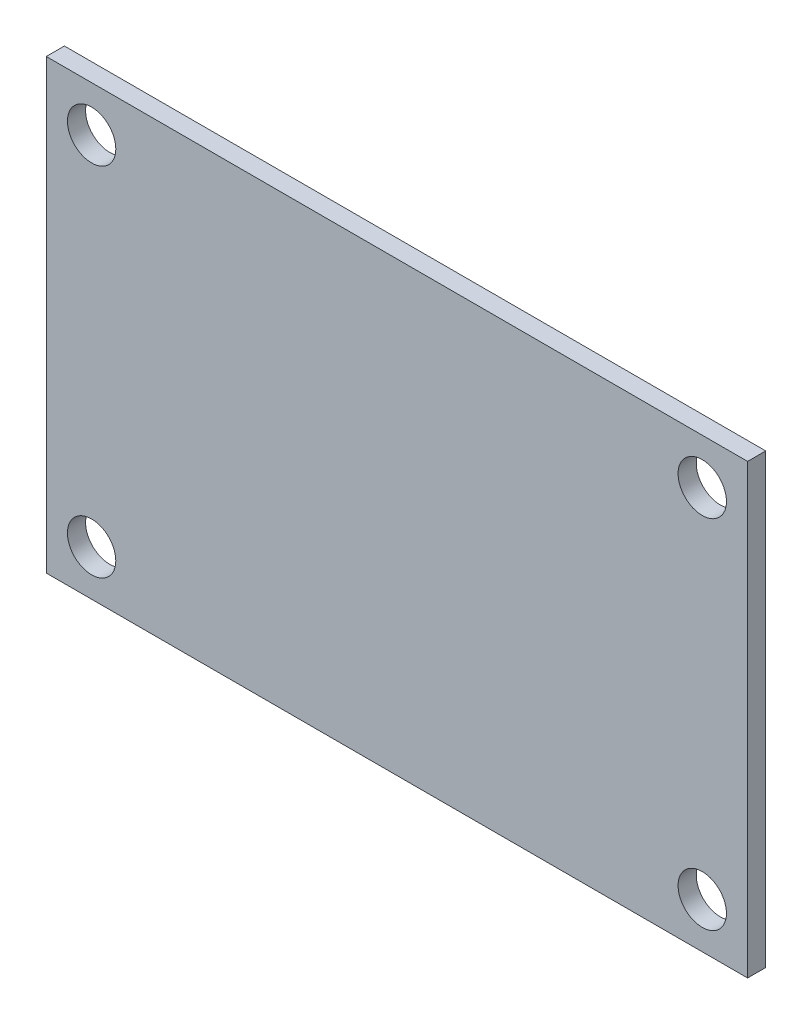
ISO-10303-21;
HEADER;
FILE_DESCRIPTION(('STEP AP214'),'2;1');
FILE_NAME('part.step','',(''),(''),'','','');
FILE_SCHEMA(('AUTOMOTIVE_DESIGN { 1 0 10303 214 1 1 1 1 }'));
ENDSEC;
DATA;
#1=APPLICATION_CONTEXT('core data for automotive mechanical design processes');
#2=APPLICATION_PROTOCOL_DEFINITION('international standard','automotive_design',2000,#1);
#3=PRODUCT_CONTEXT('',#1,'mechanical');
#4=PRODUCT('Part','Part','',(#3));
#5=PRODUCT_RELATED_PRODUCT_CATEGORY('part','',(#4));
#6=PRODUCT_DEFINITION_FORMATION('','',#4);
#7=PRODUCT_DEFINITION_CONTEXT('part definition',#1,'design');
#8=PRODUCT_DEFINITION('design','',#6,#7);
#9=PRODUCT_DEFINITION_SHAPE('','',#8);
#10=(LENGTH_UNIT() NAMED_UNIT(*) SI_UNIT(.MILLI.,.METRE.));
#11=(NAMED_UNIT(*) PLANE_ANGLE_UNIT() SI_UNIT($,.RADIAN.));
#12=(NAMED_UNIT(*) SI_UNIT($,.STERADIAN.) SOLID_ANGLE_UNIT());
#13=UNCERTAINTY_MEASURE_WITH_UNIT(LENGTH_MEASURE(1.E-05),#10,'distance_accuracy_value','');
#14=(GEOMETRIC_REPRESENTATION_CONTEXT(3) GLOBAL_UNCERTAINTY_ASSIGNED_CONTEXT((#13)) GLOBAL_UNIT_ASSIGNED_CONTEXT((#10,
#11,#12)) REPRESENTATION_CONTEXT('',''));
#15=CARTESIAN_POINT('',(0.,0.,0.));
#16=DIRECTION('',(0.,0.,1.));
#17=DIRECTION('',(1.,0.,0.));
#18=AXIS2_PLACEMENT_3D('',#15,#16,#17);
#19=CARTESIAN_POINT('',(0.,0.,1.5));
#20=DIRECTION('',(0.,0.,-1.));
#21=DIRECTION('',(-1.,0.,0.));
#22=AXIS2_PLACEMENT_3D('',#19,#20,#21);
#23=PLANE('',#22);
#24=DIRECTION('',(0.,-1.,0.));
#25=VECTOR('',#24,1.);
#26=CARTESIAN_POINT('',(0.,0.,1.5));
#27=LINE('',#26,#25);
#28=CARTESIAN_POINT('',(0.,37.,1.5));
#29=VERTEX_POINT('',#28);
#30=CARTESIAN_POINT('',(0.,0.,1.5));
#31=VERTEX_POINT('',#30);
#32=EDGE_CURVE('E85',#29,#31,#27,.T.);
#33=ORIENTED_EDGE('',*,*,#32,.T.);
#34=DIRECTION('',(1.,0.,0.));
#35=VECTOR('',#34,1.);
#36=CARTESIAN_POINT('',(0.,0.,1.5));
#37=LINE('',#36,#35);
#38=CARTESIAN_POINT('',(58.,0.,1.5));
#39=VERTEX_POINT('',#38);
#40=EDGE_CURVE('E80',#31,#39,#37,.T.);
#41=ORIENTED_EDGE('',*,*,#40,.T.);
#42=DIRECTION('',(0.,1.,0.));
#43=VECTOR('',#42,1.);
#44=CARTESIAN_POINT('',(58.,0.,1.5));
#45=LINE('',#44,#43);
#46=CARTESIAN_POINT('',(58.,37.,1.5));
#47=VERTEX_POINT('',#46);
#48=EDGE_CURVE('E83',#39,#47,#45,.T.);
#49=ORIENTED_EDGE('',*,*,#48,.T.);
#50=DIRECTION('',(-1.,0.,0.));
#51=VECTOR('',#50,1.);
#52=CARTESIAN_POINT('',(0.,37.,1.5));
#53=LINE('',#52,#51);
#54=EDGE_CURVE('E50',#47,#29,#53,.T.);
#55=ORIENTED_EDGE('',*,*,#54,.T.);
#56=EDGE_LOOP('',(#33,#41,#49,#55));
#57=FACE_BOUND('',#56,.T.);
#58=CARTESIAN_POINT('',(3.75,33.25,1.5));
#59=DIRECTION('',(0.,0.,1.));
#60=DIRECTION('',(1.,0.,0.));
#61=AXIS2_PLACEMENT_3D('',#58,#59,#60);
#62=CIRCLE('',#61,2.);
#63=CARTESIAN_POINT('',(5.75,33.25,1.5));
#64=VERTEX_POINT('',#63);
#65=EDGE_CURVE('E100',#64,#64,#62,.T.);
#66=ORIENTED_EDGE('',*,*,#65,.F.);
#67=EDGE_LOOP('',(#66));
#68=FACE_BOUND('',#67,.T.);
#69=CARTESIAN_POINT('',(54.25,33.25,1.5));
#70=DIRECTION('',(0.,0.,1.));
#71=DIRECTION('',(1.,0.,0.));
#72=AXIS2_PLACEMENT_3D('',#69,#70,#71);
#73=CIRCLE('',#72,2.);
#74=CARTESIAN_POINT('',(56.25,33.25,1.5));
#75=VERTEX_POINT('',#74);
#76=EDGE_CURVE('E115',#75,#75,#73,.T.);
#77=ORIENTED_EDGE('',*,*,#76,.F.);
#78=EDGE_LOOP('',(#77));
#79=FACE_BOUND('',#78,.T.);
#80=CARTESIAN_POINT('',(54.25,3.75,1.5));
#81=DIRECTION('',(0.,0.,1.));
#82=DIRECTION('',(1.,0.,0.));
#83=AXIS2_PLACEMENT_3D('',#80,#81,#82);
#84=CIRCLE('',#83,2.);
#85=CARTESIAN_POINT('',(56.25,3.75,1.5));
#86=VERTEX_POINT('',#85);
#87=EDGE_CURVE('E121',#86,#86,#84,.T.);
#88=ORIENTED_EDGE('',*,*,#87,.F.);
#89=EDGE_LOOP('',(#88));
#90=FACE_BOUND('',#89,.T.);
#91=CARTESIAN_POINT('',(3.75,3.75,1.5));
#92=DIRECTION('',(0.,0.,1.));
#93=DIRECTION('',(1.,0.,0.));
#94=AXIS2_PLACEMENT_3D('',#91,#92,#93);
#95=CIRCLE('',#94,2.);
#96=CARTESIAN_POINT('',(5.75,3.75,1.5));
#97=VERTEX_POINT('',#96);
#98=EDGE_CURVE('E127',#97,#97,#95,.T.);
#99=ORIENTED_EDGE('',*,*,#98,.F.);
#100=EDGE_LOOP('',(#99));
#101=FACE_BOUND('',#100,.T.);
#102=ADVANCED_FACE('F33',(#57,#68,#79,#90,#101),#23,.F.);
#103=CARTESIAN_POINT('',(0.,0.,0.));
#104=DIRECTION('',(0.,0.,-1.));
#105=DIRECTION('',(-1.,0.,0.));
#106=AXIS2_PLACEMENT_3D('',#103,#104,#105);
#107=PLANE('',#106);
#108=CARTESIAN_POINT('',(54.25,3.75,0.));
#109=DIRECTION('',(0.,0.,1.));
#110=DIRECTION('',(1.,0.,0.));
#111=AXIS2_PLACEMENT_3D('',#108,#109,#110);
#112=CIRCLE('',#111,2.);
#113=CARTESIAN_POINT('',(56.25,3.75,0.));
#114=VERTEX_POINT('',#113);
#115=EDGE_CURVE('E124',#114,#114,#112,.T.);
#116=ORIENTED_EDGE('',*,*,#115,.T.);
#117=EDGE_LOOP('',(#116));
#118=FACE_BOUND('',#117,.T.);
#119=CARTESIAN_POINT('',(3.75,33.25,0.));
#120=DIRECTION('',(0.,0.,1.));
#121=DIRECTION('',(1.,0.,0.));
#122=AXIS2_PLACEMENT_3D('',#119,#120,#121);
#123=CIRCLE('',#122,2.);
#124=CARTESIAN_POINT('',(5.75,33.25,0.));
#125=VERTEX_POINT('',#124);
#126=EDGE_CURVE('E112',#125,#125,#123,.T.);
#127=ORIENTED_EDGE('',*,*,#126,.T.);
#128=EDGE_LOOP('',(#127));
#129=FACE_BOUND('',#128,.T.);
#130=DIRECTION('',(0.,-1.,0.));
#131=VECTOR('',#130,1.);
#132=CARTESIAN_POINT('',(0.,0.,0.));
#133=LINE('',#132,#131);
#134=CARTESIAN_POINT('',(0.,37.,0.));
#135=VERTEX_POINT('',#134);
#136=CARTESIAN_POINT('',(0.,0.,0.));
#137=VERTEX_POINT('',#136);
#138=EDGE_CURVE('E97',#135,#137,#133,.T.);
#139=ORIENTED_EDGE('',*,*,#138,.F.);
#140=DIRECTION('',(-1.,0.,0.));
#141=VECTOR('',#140,1.);
#142=CARTESIAN_POINT('',(0.,37.,0.));
#143=LINE('',#142,#141);
#144=CARTESIAN_POINT('',(58.,37.,0.));
#145=VERTEX_POINT('',#144);
#146=EDGE_CURVE('E73',#145,#135,#143,.T.);
#147=ORIENTED_EDGE('',*,*,#146,.F.);
#148=DIRECTION('',(0.,1.,0.));
#149=VECTOR('',#148,1.);
#150=CARTESIAN_POINT('',(58.,0.,0.));
#151=LINE('',#150,#149);
#152=CARTESIAN_POINT('',(58.,0.,0.));
#153=VERTEX_POINT('',#152);
#154=EDGE_CURVE('E67',#153,#145,#151,.T.);
#155=ORIENTED_EDGE('',*,*,#154,.F.);
#156=DIRECTION('',(1.,0.,0.));
#157=VECTOR('',#156,1.);
#158=CARTESIAN_POINT('',(0.,0.,0.));
#159=LINE('',#158,#157);
#160=EDGE_CURVE('E89',#137,#153,#159,.T.);
#161=ORIENTED_EDGE('',*,*,#160,.F.);
#162=EDGE_LOOP('',(#139,#147,#155,#161));
#163=FACE_BOUND('',#162,.T.);
#164=CARTESIAN_POINT('',(54.25,33.25,0.));
#165=DIRECTION('',(0.,0.,1.));
#166=DIRECTION('',(1.,0.,0.));
#167=AXIS2_PLACEMENT_3D('',#164,#165,#166);
#168=CIRCLE('',#167,2.);
#169=CARTESIAN_POINT('',(56.25,33.25,0.));
#170=VERTEX_POINT('',#169);
#171=EDGE_CURVE('E118',#170,#170,#168,.T.);
#172=ORIENTED_EDGE('',*,*,#171,.T.);
#173=EDGE_LOOP('',(#172));
#174=FACE_BOUND('',#173,.T.);
#175=CARTESIAN_POINT('',(3.75,3.75,0.));
#176=DIRECTION('',(0.,0.,1.));
#177=DIRECTION('',(1.,0.,0.));
#178=AXIS2_PLACEMENT_3D('',#175,#176,#177);
#179=CIRCLE('',#178,2.);
#180=CARTESIAN_POINT('',(5.75,3.75,0.));
#181=VERTEX_POINT('',#180);
#182=EDGE_CURVE('E130',#181,#181,#179,.T.);
#183=ORIENTED_EDGE('',*,*,#182,.T.);
#184=EDGE_LOOP('',(#183));
#185=FACE_BOUND('',#184,.T.);
#186=ADVANCED_FACE('F108',(#118,#129,#163,#174,#185),#107,.T.);
#187=CARTESIAN_POINT('',(0.,0.,1.5));
#188=DIRECTION('',(1.,0.,0.));
#189=DIRECTION('',(0.,0.,-1.));
#190=AXIS2_PLACEMENT_3D('',#187,#188,#189);
#191=PLANE('',#190);
#192=ORIENTED_EDGE('',*,*,#138,.T.);
#193=DIRECTION('',(0.,0.,-1.));
#194=VECTOR('',#193,1.);
#195=CARTESIAN_POINT('',(0.,0.,1.5));
#196=LINE('',#195,#194);
#197=EDGE_CURVE('E11',#31,#137,#196,.T.);
#198=ORIENTED_EDGE('',*,*,#197,.F.);
#199=ORIENTED_EDGE('',*,*,#32,.F.);
#200=DIRECTION('',(0.,0.,-1.));
#201=VECTOR('',#200,1.);
#202=CARTESIAN_POINT('',(0.,37.,1.5));
#203=LINE('',#202,#201);
#204=EDGE_CURVE('E93',#29,#135,#203,.T.);
#205=ORIENTED_EDGE('',*,*,#204,.T.);
#206=EDGE_LOOP('',(#192,#198,#199,#205));
#207=FACE_BOUND('',#206,.T.);
#208=ADVANCED_FACE('F35',(#207),#191,.F.);
#209=CARTESIAN_POINT('',(0.,0.,1.5));
#210=DIRECTION('',(0.,1.,0.));
#211=DIRECTION('',(0.,0.,1.));
#212=AXIS2_PLACEMENT_3D('',#209,#210,#211);
#213=PLANE('',#212);
#214=ORIENTED_EDGE('',*,*,#160,.T.);
#215=DIRECTION('',(0.,0.,-1.));
#216=VECTOR('',#215,1.);
#217=CARTESIAN_POINT('',(58.,0.,1.5));
#218=LINE('',#217,#216);
#219=EDGE_CURVE('E42',#39,#153,#218,.T.);
#220=ORIENTED_EDGE('',*,*,#219,.F.);
#221=ORIENTED_EDGE('',*,*,#40,.F.);
#222=ORIENTED_EDGE('',*,*,#197,.T.);
#223=EDGE_LOOP('',(#214,#220,#221,#222));
#224=FACE_BOUND('',#223,.T.);
#225=ADVANCED_FACE('F88',(#224),#213,.F.);
#226=CARTESIAN_POINT('',(58.,0.,1.5));
#227=DIRECTION('',(-1.,0.,0.));
#228=DIRECTION('',(0.,0.,1.));
#229=AXIS2_PLACEMENT_3D('',#226,#227,#228);
#230=PLANE('',#229);
#231=ORIENTED_EDGE('',*,*,#154,.T.);
#232=DIRECTION('',(0.,0.,-1.));
#233=VECTOR('',#232,1.);
#234=CARTESIAN_POINT('',(58.,37.,1.5));
#235=LINE('',#234,#233);
#236=EDGE_CURVE('E90',#47,#145,#235,.T.);
#237=ORIENTED_EDGE('',*,*,#236,.F.);
#238=ORIENTED_EDGE('',*,*,#48,.F.);
#239=ORIENTED_EDGE('',*,*,#219,.T.);
#240=EDGE_LOOP('',(#231,#237,#238,#239));
#241=FACE_BOUND('',#240,.T.);
#242=ADVANCED_FACE('F91',(#241),#230,.F.);
#243=CARTESIAN_POINT('',(0.,37.,1.5));
#244=DIRECTION('',(0.,-1.,0.));
#245=DIRECTION('',(0.,0.,-1.));
#246=AXIS2_PLACEMENT_3D('',#243,#244,#245);
#247=PLANE('',#246);
#248=ORIENTED_EDGE('',*,*,#146,.T.);
#249=ORIENTED_EDGE('',*,*,#204,.F.);
#250=ORIENTED_EDGE('',*,*,#54,.F.);
#251=ORIENTED_EDGE('',*,*,#236,.T.);
#252=EDGE_LOOP('',(#248,#249,#250,#251));
#253=FACE_BOUND('',#252,.T.);
#254=ADVANCED_FACE('F105',(#253),#247,.F.);
#255=CARTESIAN_POINT('',(3.75,33.25,1.5));
#256=DIRECTION('',(0.,0.,-1.));
#257=DIRECTION('',(-1.,0.,0.));
#258=AXIS2_PLACEMENT_3D('',#255,#256,#257);
#259=CYLINDRICAL_SURFACE('',#258,2.);
#260=ORIENTED_EDGE('',*,*,#65,.T.);
#261=EDGE_LOOP('',(#260));
#262=FACE_BOUND('',#261,.T.);
#263=ORIENTED_EDGE('',*,*,#126,.F.);
#264=EDGE_LOOP('',(#263));
#265=FACE_BOUND('',#264,.T.);
#266=ADVANCED_FACE('F147',(#262,#265),#259,.F.);
#267=CARTESIAN_POINT('',(54.25,33.25,1.5));
#268=DIRECTION('',(0.,0.,-1.));
#269=DIRECTION('',(-1.,0.,0.));
#270=AXIS2_PLACEMENT_3D('',#267,#268,#269);
#271=CYLINDRICAL_SURFACE('',#270,2.);
#272=ORIENTED_EDGE('',*,*,#76,.T.);
#273=EDGE_LOOP('',(#272));
#274=FACE_BOUND('',#273,.T.);
#275=ORIENTED_EDGE('',*,*,#171,.F.);
#276=EDGE_LOOP('',(#275));
#277=FACE_BOUND('',#276,.T.);
#278=ADVANCED_FACE('F193',(#274,#277),#271,.F.);
#279=CARTESIAN_POINT('',(54.25,3.75,1.5));
#280=DIRECTION('',(0.,0.,-1.));
#281=DIRECTION('',(-1.,0.,0.));
#282=AXIS2_PLACEMENT_3D('',#279,#280,#281);
#283=CYLINDRICAL_SURFACE('',#282,2.);
#284=ORIENTED_EDGE('',*,*,#87,.T.);
#285=EDGE_LOOP('',(#284));
#286=FACE_BOUND('',#285,.T.);
#287=ORIENTED_EDGE('',*,*,#115,.F.);
#288=EDGE_LOOP('',(#287));
#289=FACE_BOUND('',#288,.T.);
#290=ADVANCED_FACE('F201',(#286,#289),#283,.F.);
#291=CARTESIAN_POINT('',(3.75,3.75,1.5));
#292=DIRECTION('',(0.,0.,-1.));
#293=DIRECTION('',(-1.,0.,0.));
#294=AXIS2_PLACEMENT_3D('',#291,#292,#293);
#295=CYLINDRICAL_SURFACE('',#294,2.);
#296=ORIENTED_EDGE('',*,*,#98,.T.);
#297=EDGE_LOOP('',(#296));
#298=FACE_BOUND('',#297,.T.);
#299=ORIENTED_EDGE('',*,*,#182,.F.);
#300=EDGE_LOOP('',(#299));
#301=FACE_BOUND('',#300,.T.);
#302=ADVANCED_FACE('F136',(#298,#301),#295,.F.);
#303=CLOSED_SHELL('',(#102,#186,#208,#225,#242,#254,#266,#278,#290,#302));
#304=MANIFOLD_SOLID_BREP('B2',#303);
#305=ADVANCED_BREP_SHAPE_REPRESENTATION('',(#18,#304),#14);
#306=SHAPE_DEFINITION_REPRESENTATION(#9,#305);
ENDSEC;
END-ISO-10303-21;
